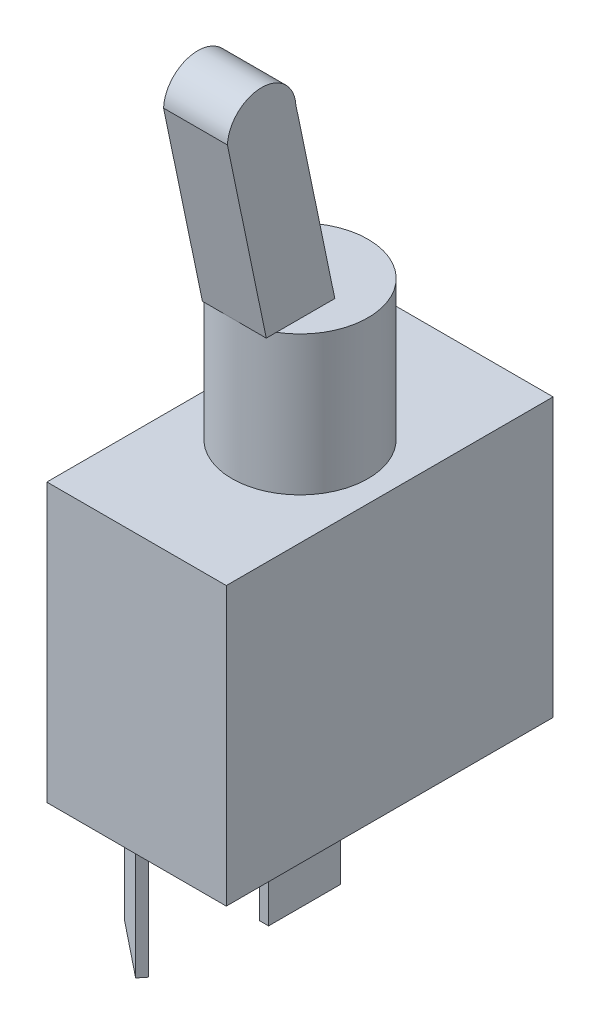
ISO-10303-21;
HEADER;
FILE_DESCRIPTION(('STEP AP214'),'2;1');
FILE_NAME('part.step','',(''),(''),'','','');
FILE_SCHEMA(('AUTOMOTIVE_DESIGN { 1 0 10303 214 1 1 1 1 }'));
ENDSEC;
DATA;
#1=APPLICATION_CONTEXT('core data for automotive mechanical design processes');
#2=APPLICATION_PROTOCOL_DEFINITION('international standard','automotive_design',2000,#1);
#3=PRODUCT_CONTEXT('',#1,'mechanical');
#4=PRODUCT('Part','Part','',(#3));
#5=PRODUCT_RELATED_PRODUCT_CATEGORY('part','',(#4));
#6=PRODUCT_DEFINITION_FORMATION('','',#4);
#7=PRODUCT_DEFINITION_CONTEXT('part definition',#1,'design');
#8=PRODUCT_DEFINITION('design','',#6,#7);
#9=PRODUCT_DEFINITION_SHAPE('','',#8);
#10=(LENGTH_UNIT() NAMED_UNIT(*) SI_UNIT(.MILLI.,.METRE.));
#11=(NAMED_UNIT(*) PLANE_ANGLE_UNIT() SI_UNIT($,.RADIAN.));
#12=(NAMED_UNIT(*) SI_UNIT($,.STERADIAN.) SOLID_ANGLE_UNIT());
#13=UNCERTAINTY_MEASURE_WITH_UNIT(LENGTH_MEASURE(1.E-05),#10,'distance_accuracy_value','');
#14=(GEOMETRIC_REPRESENTATION_CONTEXT(3) GLOBAL_UNCERTAINTY_ASSIGNED_CONTEXT((#13)) GLOBAL_UNIT_ASSIGNED_CONTEXT((#10,
#11,#12)) REPRESENTATION_CONTEXT('',''));
#15=CARTESIAN_POINT('',(0.,0.,0.));
#16=DIRECTION('',(0.,0.,1.));
#17=DIRECTION('',(1.,0.,0.));
#18=AXIS2_PLACEMENT_3D('',#15,#16,#17);
#19=CARTESIAN_POINT('',(0.,0.,0.));
#20=DIRECTION('',(0.,1.,0.));
#21=DIRECTION('',(0.,0.,1.));
#22=AXIS2_PLACEMENT_3D('',#19,#20,#21);
#23=PLANE('',#22);
#24=DIRECTION('',(0.,0.,-1.));
#25=VECTOR('',#24,1.);
#26=CARTESIAN_POINT('',(-0.400000000000001,0.,3.15));
#27=LINE('',#26,#25);
#28=CARTESIAN_POINT('',(-0.400000000000001,0.,3.15));
#29=VERTEX_POINT('',#28);
#30=CARTESIAN_POINT('',(-0.4,0.,-3.15));
#31=VERTEX_POINT('',#30);
#32=EDGE_CURVE('E175',#29,#31,#27,.T.);
#33=ORIENTED_EDGE('',*,*,#32,.F.);
#34=DIRECTION('',(-1.,0.,0.));
#35=VECTOR('',#34,1.);
#36=CARTESIAN_POINT('',(-0.400000000000001,0.,3.15));
#37=LINE('',#36,#35);
#38=CARTESIAN_POINT('',(0.399999999999999,0.,3.15));
#39=VERTEX_POINT('',#38);
#40=EDGE_CURVE('E188',#39,#29,#37,.T.);
#41=ORIENTED_EDGE('',*,*,#40,.F.);
#42=DIRECTION('',(0.,0.,1.));
#43=VECTOR('',#42,1.);
#44=CARTESIAN_POINT('',(0.399999999999999,0.,3.15));
#45=LINE('',#44,#43);
#46=CARTESIAN_POINT('',(0.4,0.,-3.15));
#47=VERTEX_POINT('',#46);
#48=EDGE_CURVE('E197',#47,#39,#45,.T.);
#49=ORIENTED_EDGE('',*,*,#48,.F.);
#50=DIRECTION('',(1.,0.,0.));
#51=VECTOR('',#50,1.);
#52=CARTESIAN_POINT('',(-0.4,0.,-3.15));
#53=LINE('',#52,#51);
#54=EDGE_CURVE('E178',#31,#47,#53,.T.);
#55=ORIENTED_EDGE('',*,*,#54,.F.);
#56=EDGE_LOOP('',(#33,#41,#49,#55));
#57=FACE_BOUND('',#56,.T.);
#58=DIRECTION('',(0.,0.,-1.));
#59=VECTOR('',#58,1.);
#60=CARTESIAN_POINT('',(7.85,0.,-14.3));
#61=LINE('',#60,#59);
#62=CARTESIAN_POINT('',(7.85,0.,14.3));
#63=VERTEX_POINT('',#62);
#64=CARTESIAN_POINT('',(7.85,0.,-14.3));
#65=VERTEX_POINT('',#64);
#66=EDGE_CURVE('E248',#63,#65,#61,.T.);
#67=ORIENTED_EDGE('',*,*,#66,.F.);
#68=DIRECTION('',(1.,0.,0.));
#69=VECTOR('',#68,1.);
#70=CARTESIAN_POINT('',(-7.85,0.,14.3));
#71=LINE('',#70,#69);
#72=CARTESIAN_POINT('',(-7.85,0.,14.3));
#73=VERTEX_POINT('',#72);
#74=EDGE_CURVE('E256',#73,#63,#71,.T.);
#75=ORIENTED_EDGE('',*,*,#74,.F.);
#76=DIRECTION('',(0.,0.,1.));
#77=VECTOR('',#76,1.);
#78=CARTESIAN_POINT('',(-7.85,0.,-14.3));
#79=LINE('',#78,#77);
#80=CARTESIAN_POINT('',(-7.85,0.,-14.3));
#81=VERTEX_POINT('',#80);
#82=EDGE_CURVE('E267',#81,#73,#79,.T.);
#83=ORIENTED_EDGE('',*,*,#82,.F.);
#84=DIRECTION('',(-1.,0.,0.));
#85=VECTOR('',#84,1.);
#86=CARTESIAN_POINT('',(-7.85,0.,-14.3));
#87=LINE('',#86,#85);
#88=EDGE_CURVE('E265',#65,#81,#87,.T.);
#89=ORIENTED_EDGE('',*,*,#88,.F.);
#90=EDGE_LOOP('',(#67,#75,#83,#89));
#91=FACE_BOUND('',#90,.T.);
#92=DIRECTION('',(-0.780868809443029,0.,-0.624695047554426));
#93=VECTOR('',#92,1.);
#94=CARTESIAN_POINT('',(-6.39093150433474,0.,8.97678211683683));
#95=LINE('',#94,#93);
#96=CARTESIAN_POINT('',(-1.47145800484366,0.,12.9123609164297));
#97=VERTEX_POINT('',#96);
#98=CARTESIAN_POINT('',(-6.39093150433474,0.,8.97678211683683));
#99=VERTEX_POINT('',#98);
#100=EDGE_CURVE('E174',#97,#99,#95,.T.);
#101=ORIENTED_EDGE('',*,*,#100,.F.);
#102=DIRECTION('',(-0.624695047554425,0.,0.78086880944303));
#103=VECTOR('',#102,1.);
#104=CARTESIAN_POINT('',(-1.47145800484366,0.,12.9123609164297));
#105=LINE('',#104,#103);
#106=CARTESIAN_POINT('',(-0.971701966800116,0.,12.2876658688753));
#107=VERTEX_POINT('',#106);
#108=EDGE_CURVE('E171',#107,#97,#105,.T.);
#109=ORIENTED_EDGE('',*,*,#108,.F.);
#110=DIRECTION('',(0.780868809443029,0.,0.624695047554426));
#111=VECTOR('',#110,1.);
#112=CARTESIAN_POINT('',(-5.8911754662912,0.,8.35208706928241));
#113=LINE('',#112,#111);
#114=CARTESIAN_POINT('',(-5.8911754662912,0.,8.35208706928241));
#115=VERTEX_POINT('',#114);
#116=EDGE_CURVE('E56',#115,#107,#113,.T.);
#117=ORIENTED_EDGE('',*,*,#116,.F.);
#118=DIRECTION('',(0.624695047554426,0.,-0.780868809443029));
#119=VECTOR('',#118,1.);
#120=CARTESIAN_POINT('',(-6.39093150433474,0.,8.97678211683683));
#121=LINE('',#120,#119);
#122=EDGE_CURVE('E51',#99,#115,#121,.T.);
#123=ORIENTED_EDGE('',*,*,#122,.F.);
#124=EDGE_LOOP('',(#101,#109,#117,#123));
#125=FACE_BOUND('',#124,.T.);
#126=ADVANCED_FACE('F33',(#57,#91,#125),#23,.F.);
#127=CARTESIAN_POINT('',(7.85,24.3,-14.3));
#128=DIRECTION('',(-1.,0.,0.));
#129=DIRECTION('',(0.,0.,1.));
#130=AXIS2_PLACEMENT_3D('',#127,#128,#129);
#131=PLANE('',#130);
#132=ORIENTED_EDGE('',*,*,#66,.T.);
#133=DIRECTION('',(0.,-1.,0.));
#134=VECTOR('',#133,1.);
#135=CARTESIAN_POINT('',(7.85,24.3,-14.3));
#136=LINE('',#135,#134);
#137=CARTESIAN_POINT('',(7.85,24.3,-14.3));
#138=VERTEX_POINT('',#137);
#139=EDGE_CURVE('E37',#138,#65,#136,.T.);
#140=ORIENTED_EDGE('',*,*,#139,.F.);
#141=DIRECTION('',(0.,0.,-1.));
#142=VECTOR('',#141,1.);
#143=CARTESIAN_POINT('',(7.85,24.3,-14.3));
#144=LINE('',#143,#142);
#145=CARTESIAN_POINT('',(7.85,24.3,14.3));
#146=VERTEX_POINT('',#145);
#147=EDGE_CURVE('E252',#146,#138,#144,.T.);
#148=ORIENTED_EDGE('',*,*,#147,.F.);
#149=DIRECTION('',(0.,-1.,0.));
#150=VECTOR('',#149,1.);
#151=CARTESIAN_POINT('',(7.85,24.3,14.3));
#152=LINE('',#151,#150);
#153=EDGE_CURVE('E262',#146,#63,#152,.T.);
#154=ORIENTED_EDGE('',*,*,#153,.T.);
#155=EDGE_LOOP('',(#132,#140,#148,#154));
#156=FACE_BOUND('',#155,.T.);
#157=ADVANCED_FACE('F35',(#156),#131,.F.);
#158=CARTESIAN_POINT('',(-7.85,24.3,-14.3));
#159=DIRECTION('',(0.,0.,1.));
#160=DIRECTION('',(1.,0.,0.));
#161=AXIS2_PLACEMENT_3D('',#158,#159,#160);
#162=PLANE('',#161);
#163=ORIENTED_EDGE('',*,*,#88,.T.);
#164=DIRECTION('',(0.,-1.,0.));
#165=VECTOR('',#164,1.);
#166=CARTESIAN_POINT('',(-7.85,24.3,-14.3));
#167=LINE('',#166,#165);
#168=CARTESIAN_POINT('',(-7.85,24.3,-14.3));
#169=VERTEX_POINT('',#168);
#170=EDGE_CURVE('E274',#169,#81,#167,.T.);
#171=ORIENTED_EDGE('',*,*,#170,.F.);
#172=DIRECTION('',(-1.,0.,0.));
#173=VECTOR('',#172,1.);
#174=CARTESIAN_POINT('',(-7.85,24.3,-14.3));
#175=LINE('',#174,#173);
#176=EDGE_CURVE('E255',#138,#169,#175,.T.);
#177=ORIENTED_EDGE('',*,*,#176,.F.);
#178=ORIENTED_EDGE('',*,*,#139,.T.);
#179=EDGE_LOOP('',(#163,#171,#177,#178));
#180=FACE_BOUND('',#179,.T.);
#181=ADVANCED_FACE('F317',(#180),#162,.F.);
#182=CARTESIAN_POINT('',(-7.85,24.3,-14.3));
#183=DIRECTION('',(1.,0.,0.));
#184=DIRECTION('',(0.,0.,-1.));
#185=AXIS2_PLACEMENT_3D('',#182,#183,#184);
#186=PLANE('',#185);
#187=ORIENTED_EDGE('',*,*,#82,.T.);
#188=DIRECTION('',(0.,-1.,0.));
#189=VECTOR('',#188,1.);
#190=CARTESIAN_POINT('',(-7.85,24.3,14.3));
#191=LINE('',#190,#189);
#192=CARTESIAN_POINT('',(-7.85,24.3,14.3));
#193=VERTEX_POINT('',#192);
#194=EDGE_CURVE('E272',#193,#73,#191,.T.);
#195=ORIENTED_EDGE('',*,*,#194,.F.);
#196=DIRECTION('',(0.,0.,1.));
#197=VECTOR('',#196,1.);
#198=CARTESIAN_POINT('',(-7.85,24.3,-14.3));
#199=LINE('',#198,#197);
#200=EDGE_CURVE('E258',#169,#193,#199,.T.);
#201=ORIENTED_EDGE('',*,*,#200,.F.);
#202=ORIENTED_EDGE('',*,*,#170,.T.);
#203=EDGE_LOOP('',(#187,#195,#201,#202));
#204=FACE_BOUND('',#203,.T.);
#205=ADVANCED_FACE('F319',(#204),#186,.F.);
#206=CARTESIAN_POINT('',(-7.85,24.3,14.3));
#207=DIRECTION('',(0.,0.,-1.));
#208=DIRECTION('',(-1.,0.,0.));
#209=AXIS2_PLACEMENT_3D('',#206,#207,#208);
#210=PLANE('',#209);
#211=ORIENTED_EDGE('',*,*,#74,.T.);
#212=ORIENTED_EDGE('',*,*,#153,.F.);
#213=DIRECTION('',(1.,0.,0.));
#214=VECTOR('',#213,1.);
#215=CARTESIAN_POINT('',(-7.85,24.3,14.3));
#216=LINE('',#215,#214);
#217=EDGE_CURVE('E260',#193,#146,#216,.T.);
#218=ORIENTED_EDGE('',*,*,#217,.F.);
#219=ORIENTED_EDGE('',*,*,#194,.T.);
#220=EDGE_LOOP('',(#211,#212,#218,#219));
#221=FACE_BOUND('',#220,.T.);
#222=ADVANCED_FACE('F308',(#221),#210,.F.);
#223=CARTESIAN_POINT('',(0.,24.3,0.));
#224=DIRECTION('',(0.,1.,0.));
#225=DIRECTION('',(0.,0.,1.));
#226=AXIS2_PLACEMENT_3D('',#223,#224,#225);
#227=PLANE('',#226);
#228=CARTESIAN_POINT('',(0.,24.3,0.));
#229=DIRECTION('',(0.,1.,0.));
#230=DIRECTION('',(0.,0.,1.));
#231=AXIS2_PLACEMENT_3D('',#228,#229,#230);
#232=CIRCLE('',#231,5.953125);
#233=CARTESIAN_POINT('',(0.,24.3,5.953125));
#234=VERTEX_POINT('',#233);
#235=EDGE_CURVE('E239',#234,#234,#232,.T.);
#236=ORIENTED_EDGE('',*,*,#235,.F.);
#237=EDGE_LOOP('',(#236));
#238=FACE_BOUND('',#237,.T.);
#239=ORIENTED_EDGE('',*,*,#147,.T.);
#240=ORIENTED_EDGE('',*,*,#176,.T.);
#241=ORIENTED_EDGE('',*,*,#200,.T.);
#242=ORIENTED_EDGE('',*,*,#217,.T.);
#243=EDGE_LOOP('',(#239,#240,#241,#242));
#244=FACE_BOUND('',#243,.T.);
#245=ADVANCED_FACE('F302',(#238,#244),#227,.T.);
#246=CARTESIAN_POINT('',(0.,36.5,0.));
#247=DIRECTION('',(0.,-1.,0.));
#248=DIRECTION('',(0.,0.,-1.));
#249=AXIS2_PLACEMENT_3D('',#246,#247,#248);
#250=CYLINDRICAL_SURFACE('',#249,5.953125);
#251=CARTESIAN_POINT('',(0.,36.5,0.));
#252=DIRECTION('',(0.,1.,0.));
#253=DIRECTION('',(0.,0.,1.));
#254=AXIS2_PLACEMENT_3D('',#251,#252,#253);
#255=CIRCLE('',#254,5.953125);
#256=CARTESIAN_POINT('',(3.048,36.5,5.11364774555551));
#257=VERTEX_POINT('',#256);
#258=CARTESIAN_POINT('',(-2.54,36.5,5.38405955257044));
#259=VERTEX_POINT('',#258);
#260=EDGE_CURVE('E245',#257,#259,#255,.T.);
#261=ORIENTED_EDGE('',*,*,#260,.F.);
#262=EDGE_CURVE('E249',#259,#257,#255,.T.);
#263=ORIENTED_EDGE('',*,*,#262,.F.);
#264=EDGE_LOOP('',(#261,#263));
#265=FACE_BOUND('',#264,.T.);
#266=ORIENTED_EDGE('',*,*,#235,.T.);
#267=EDGE_LOOP('',(#266));
#268=FACE_BOUND('',#267,.T.);
#269=ADVANCED_FACE('F299',(#265,#268),#250,.T.);
#270=CARTESIAN_POINT('',(0.,36.5,0.));
#271=DIRECTION('',(0.,1.,0.));
#272=DIRECTION('',(0.,0.,1.));
#273=AXIS2_PLACEMENT_3D('',#270,#271,#272);
#274=PLANE('',#273);
#275=DIRECTION('',(0.,0.,-1.));
#276=VECTOR('',#275,1.);
#277=CARTESIAN_POINT('',(3.048,36.5,0.));
#278=LINE('',#277,#276);
#279=CARTESIAN_POINT('',(3.048,36.5,0.));
#280=VERTEX_POINT('',#279);
#281=EDGE_CURVE('E11',#257,#280,#278,.T.);
#282=ORIENTED_EDGE('',*,*,#281,.F.);
#283=ORIENTED_EDGE('',*,*,#260,.T.);
#284=DIRECTION('',(0.,0.,-1.));
#285=VECTOR('',#284,1.);
#286=CARTESIAN_POINT('',(-2.54,36.5,0.));
#287=LINE('',#286,#285);
#288=CARTESIAN_POINT('',(-2.54,36.5,0.));
#289=VERTEX_POINT('',#288);
#290=EDGE_CURVE('E42',#259,#289,#287,.T.);
#291=ORIENTED_EDGE('',*,*,#290,.T.);
#292=DIRECTION('',(1.,0.,0.));
#293=VECTOR('',#292,1.);
#294=CARTESIAN_POINT('',(-2.54,36.5,0.));
#295=LINE('',#294,#293);
#296=EDGE_CURVE('E236',#289,#280,#295,.T.);
#297=ORIENTED_EDGE('',*,*,#296,.T.);
#298=EDGE_LOOP('',(#282,#283,#291,#297));
#299=FACE_BOUND('',#298,.T.);
#300=ADVANCED_FACE('F286',(#299),#274,.T.);
#301=CARTESIAN_POINT('',(-2.54,36.5,0.));
#302=DIRECTION('',(0.,0.20373891327795,-0.979025257700903));
#303=DIRECTION('',(0.,0.979025257700903,0.20373891327795));
#304=AXIS2_PLACEMENT_3D('',#301,#302,#303);
#305=PLANE('',#304);
#306=DIRECTION('',(1.,0.,0.));
#307=VECTOR('',#306,1.);
#308=CARTESIAN_POINT('',(-2.54,52.8859666746955,3.40998254851059));
#309=LINE('',#308,#307);
#310=CARTESIAN_POINT('',(-2.54,52.8859666746955,3.40998254851059));
#311=VERTEX_POINT('',#310);
#312=CARTESIAN_POINT('',(3.048,52.8859666746955,3.40998254851059));
#313=VERTEX_POINT('',#312);
#314=EDGE_CURVE('E235',#311,#313,#309,.T.);
#315=ORIENTED_EDGE('',*,*,#314,.T.);
#316=DIRECTION('',(0.,0.979025257700903,0.20373891327795));
#317=VECTOR('',#316,1.);
#318=CARTESIAN_POINT('',(3.048,36.5,0.));
#319=LINE('',#318,#317);
#320=EDGE_CURVE('E213',#280,#313,#319,.T.);
#321=ORIENTED_EDGE('',*,*,#320,.F.);
#322=ORIENTED_EDGE('',*,*,#296,.F.);
#323=DIRECTION('',(0.,0.979025257700903,0.20373891327795));
#324=VECTOR('',#323,1.);
#325=CARTESIAN_POINT('',(-2.54,36.5,0.));
#326=LINE('',#325,#324);
#327=EDGE_CURVE('E223',#289,#311,#326,.T.);
#328=ORIENTED_EDGE('',*,*,#327,.T.);
#329=EDGE_LOOP('',(#315,#321,#322,#328));
#330=FACE_BOUND('',#329,.T.);
#331=ADVANCED_FACE('F336',(#330),#305,.T.);
#332=CARTESIAN_POINT('',(-2.54,36.5,0.));
#333=DIRECTION('',(0.,-1.,0.));
#334=DIRECTION('',(0.,0.,-1.));
#335=AXIS2_PLACEMENT_3D('',#332,#333,#334);
#336=PLANE('',#335);
#337=CARTESIAN_POINT('',(-2.54,36.5,6.));
#338=VERTEX_POINT('',#337);
#339=EDGE_CURVE('E232',#338,#259,#287,.T.);
#340=ORIENTED_EDGE('',*,*,#339,.T.);
#341=ORIENTED_EDGE('',*,*,#262,.T.);
#342=CARTESIAN_POINT('',(3.048,36.5,6.));
#343=VERTEX_POINT('',#342);
#344=EDGE_CURVE('E44',#343,#257,#278,.T.);
#345=ORIENTED_EDGE('',*,*,#344,.F.);
#346=DIRECTION('',(1.,0.,0.));
#347=VECTOR('',#346,1.);
#348=CARTESIAN_POINT('',(-2.54,36.5,6.));
#349=LINE('',#348,#347);
#350=EDGE_CURVE('E240',#338,#343,#349,.T.);
#351=ORIENTED_EDGE('',*,*,#350,.F.);
#352=EDGE_LOOP('',(#340,#341,#345,#351));
#353=FACE_BOUND('',#352,.T.);
#354=ADVANCED_FACE('F296',(#353),#336,.T.);
#355=CARTESIAN_POINT('',(-2.54,36.5,6.));
#356=DIRECTION('',(0.,-0.20373891327795,0.979025257700903));
#357=DIRECTION('',(0.,-0.979025257700903,-0.20373891327795));
#358=AXIS2_PLACEMENT_3D('',#355,#356,#357);
#359=PLANE('',#358);
#360=ORIENTED_EDGE('',*,*,#350,.T.);
#361=DIRECTION('',(0.,-0.979025257700903,-0.20373891327795));
#362=VECTOR('',#361,1.);
#363=CARTESIAN_POINT('',(3.048,36.5,6.));
#364=LINE('',#363,#362);
#365=CARTESIAN_POINT('',(3.048,52.8420688870723,9.40084725044212));
#366=VERTEX_POINT('',#365);
#367=EDGE_CURVE('E219',#366,#343,#364,.T.);
#368=ORIENTED_EDGE('',*,*,#367,.F.);
#369=DIRECTION('',(1.,0.,0.));
#370=VECTOR('',#369,1.);
#371=CARTESIAN_POINT('',(-2.54,52.8420688870723,9.40084725044212));
#372=LINE('',#371,#370);
#373=CARTESIAN_POINT('',(-2.54,52.8420688870723,9.40084725044212));
#374=VERTEX_POINT('',#373);
#375=EDGE_CURVE('E242',#374,#366,#372,.T.);
#376=ORIENTED_EDGE('',*,*,#375,.F.);
#377=DIRECTION('',(0.,-0.979025257700903,-0.20373891327795));
#378=VECTOR('',#377,1.);
#379=CARTESIAN_POINT('',(-2.54,36.5,6.));
#380=LINE('',#379,#378);
#381=EDGE_CURVE('E229',#374,#338,#380,.T.);
#382=ORIENTED_EDGE('',*,*,#381,.T.);
#383=EDGE_LOOP('',(#360,#368,#376,#382));
#384=FACE_BOUND('',#383,.T.);
#385=ADVANCED_FACE('F343',(#384),#359,.T.);
#386=CARTESIAN_POINT('',(-2.54,52.7,6.40421306667426));
#387=DIRECTION('',(1.,0.,0.));
#388=DIRECTION('',(0.,0.,-1.));
#389=AXIS2_PLACEMENT_3D('',#386,#387,#388);
#390=CYLINDRICAL_SURFACE('',#389,3.);
#391=ORIENTED_EDGE('',*,*,#375,.T.);
#392=CARTESIAN_POINT('',(3.048,52.7,6.40421306667426));
#393=DIRECTION('',(1.,0.,0.));
#394=DIRECTION('',(0.,0.,-1.));
#395=AXIS2_PLACEMENT_3D('',#392,#393,#394);
#396=CIRCLE('',#395,3.);
#397=EDGE_CURVE('E216',#313,#366,#396,.T.);
#398=ORIENTED_EDGE('',*,*,#397,.F.);
#399=ORIENTED_EDGE('',*,*,#314,.F.);
#400=CARTESIAN_POINT('',(-2.54,52.7,6.40421306667426));
#401=DIRECTION('',(1.,0.,0.));
#402=DIRECTION('',(0.,0.,-1.));
#403=AXIS2_PLACEMENT_3D('',#400,#401,#402);
#404=CIRCLE('',#403,3.);
#405=EDGE_CURVE('E226',#311,#374,#404,.T.);
#406=ORIENTED_EDGE('',*,*,#405,.T.);
#407=EDGE_LOOP('',(#391,#398,#399,#406));
#408=FACE_BOUND('',#407,.T.);
#409=ADVANCED_FACE('F340',(#408),#390,.T.);
#410=CARTESIAN_POINT('',(-2.54,52.7,6.40421306667426));
#411=DIRECTION('',(1.,0.,0.));
#412=DIRECTION('',(0.,0.,-1.));
#413=AXIS2_PLACEMENT_3D('',#410,#411,#412);
#414=PLANE('',#413);
#415=ORIENTED_EDGE('',*,*,#327,.F.);
#416=ORIENTED_EDGE('',*,*,#290,.F.);
#417=ORIENTED_EDGE('',*,*,#339,.F.);
#418=ORIENTED_EDGE('',*,*,#381,.F.);
#419=ORIENTED_EDGE('',*,*,#405,.F.);
#420=EDGE_LOOP('',(#415,#416,#417,#418,#419));
#421=FACE_BOUND('',#420,.T.);
#422=ADVANCED_FACE('F291',(#421),#414,.F.);
#423=CARTESIAN_POINT('',(3.048,52.7,6.40421306667426));
#424=DIRECTION('',(1.,0.,0.));
#425=DIRECTION('',(0.,0.,-1.));
#426=AXIS2_PLACEMENT_3D('',#423,#424,#425);
#427=PLANE('',#426);
#428=ORIENTED_EDGE('',*,*,#320,.T.);
#429=ORIENTED_EDGE('',*,*,#397,.T.);
#430=ORIENTED_EDGE('',*,*,#367,.T.);
#431=ORIENTED_EDGE('',*,*,#344,.T.);
#432=ORIENTED_EDGE('',*,*,#281,.T.);
#433=EDGE_LOOP('',(#428,#429,#430,#431,#432));
#434=FACE_BOUND('',#433,.T.);
#435=ADVANCED_FACE('F352',(#434),#427,.T.);
#436=CARTESIAN_POINT('',(-0.400000000000001,-10.8,3.15));
#437=DIRECTION('',(1.,0.,0.));
#438=DIRECTION('',(0.,0.,-1.));
#439=AXIS2_PLACEMENT_3D('',#436,#437,#438);
#440=PLANE('',#439);
#441=ORIENTED_EDGE('',*,*,#32,.T.);
#442=DIRECTION('',(0.,1.,0.));
#443=VECTOR('',#442,1.);
#444=CARTESIAN_POINT('',(-0.4,-10.8,-3.15));
#445=LINE('',#444,#443);
#446=CARTESIAN_POINT('',(-0.4,-10.8,-3.15));
#447=VERTEX_POINT('',#446);
#448=EDGE_CURVE('E210',#447,#31,#445,.T.);
#449=ORIENTED_EDGE('',*,*,#448,.F.);
#450=DIRECTION('',(0.,0.,-1.));
#451=VECTOR('',#450,1.);
#452=CARTESIAN_POINT('',(-0.400000000000001,-10.8,3.15));
#453=LINE('',#452,#451);
#454=CARTESIAN_POINT('',(-0.400000000000001,-10.8,3.15));
#455=VERTEX_POINT('',#454);
#456=EDGE_CURVE('E184',#455,#447,#453,.T.);
#457=ORIENTED_EDGE('',*,*,#456,.F.);
#458=DIRECTION('',(0.,1.,0.));
#459=VECTOR('',#458,1.);
#460=CARTESIAN_POINT('',(-0.400000000000001,-10.8,3.15));
#461=LINE('',#460,#459);
#462=EDGE_CURVE('E193',#455,#29,#461,.T.);
#463=ORIENTED_EDGE('',*,*,#462,.T.);
#464=EDGE_LOOP('',(#441,#449,#457,#463));
#465=FACE_BOUND('',#464,.T.);
#466=ADVANCED_FACE('F355',(#465),#440,.F.);
#467=CARTESIAN_POINT('',(-0.4,-10.8,-3.15));
#468=DIRECTION('',(0.,0.,1.));
#469=DIRECTION('',(1.,0.,0.));
#470=AXIS2_PLACEMENT_3D('',#467,#468,#469);
#471=PLANE('',#470);
#472=ORIENTED_EDGE('',*,*,#54,.T.);
#473=DIRECTION('',(0.,1.,0.));
#474=VECTOR('',#473,1.);
#475=CARTESIAN_POINT('',(0.4,-10.8,-3.15));
#476=LINE('',#475,#474);
#477=CARTESIAN_POINT('',(0.4,-10.8,-3.15));
#478=VERTEX_POINT('',#477);
#479=EDGE_CURVE('E207',#478,#47,#476,.T.);
#480=ORIENTED_EDGE('',*,*,#479,.F.);
#481=DIRECTION('',(1.,0.,0.));
#482=VECTOR('',#481,1.);
#483=CARTESIAN_POINT('',(-0.4,-10.8,-3.15));
#484=LINE('',#483,#482);
#485=EDGE_CURVE('E187',#447,#478,#484,.T.);
#486=ORIENTED_EDGE('',*,*,#485,.F.);
#487=ORIENTED_EDGE('',*,*,#448,.T.);
#488=EDGE_LOOP('',(#472,#480,#486,#487));
#489=FACE_BOUND('',#488,.T.);
#490=ADVANCED_FACE('F359',(#489),#471,.F.);
#491=CARTESIAN_POINT('',(0.399999999999999,-10.8,3.15));
#492=DIRECTION('',(-1.,0.,0.));
#493=DIRECTION('',(0.,0.,1.));
#494=AXIS2_PLACEMENT_3D('',#491,#492,#493);
#495=PLANE('',#494);
#496=ORIENTED_EDGE('',*,*,#48,.T.);
#497=DIRECTION('',(0.,1.,0.));
#498=VECTOR('',#497,1.);
#499=CARTESIAN_POINT('',(0.399999999999999,-10.8,3.15));
#500=LINE('',#499,#498);
#501=CARTESIAN_POINT('',(0.399999999999999,-10.8,3.15));
#502=VERTEX_POINT('',#501);
#503=EDGE_CURVE('E204',#502,#39,#500,.T.);
#504=ORIENTED_EDGE('',*,*,#503,.F.);
#505=DIRECTION('',(0.,0.,1.));
#506=VECTOR('',#505,1.);
#507=CARTESIAN_POINT('',(0.399999999999999,-10.8,3.15));
#508=LINE('',#507,#506);
#509=EDGE_CURVE('E190',#478,#502,#508,.T.);
#510=ORIENTED_EDGE('',*,*,#509,.F.);
#511=ORIENTED_EDGE('',*,*,#479,.T.);
#512=EDGE_LOOP('',(#496,#504,#510,#511));
#513=FACE_BOUND('',#512,.T.);
#514=ADVANCED_FACE('F363',(#513),#495,.F.);
#515=CARTESIAN_POINT('',(-0.400000000000001,-10.8,3.15));
#516=DIRECTION('',(0.,0.,-1.));
#517=DIRECTION('',(-1.,0.,0.));
#518=AXIS2_PLACEMENT_3D('',#515,#516,#517);
#519=PLANE('',#518);
#520=ORIENTED_EDGE('',*,*,#40,.T.);
#521=ORIENTED_EDGE('',*,*,#462,.F.);
#522=DIRECTION('',(-1.,0.,0.));
#523=VECTOR('',#522,1.);
#524=CARTESIAN_POINT('',(-0.400000000000001,-10.8,3.15));
#525=LINE('',#524,#523);
#526=EDGE_CURVE('E192',#502,#455,#525,.T.);
#527=ORIENTED_EDGE('',*,*,#526,.F.);
#528=ORIENTED_EDGE('',*,*,#503,.T.);
#529=EDGE_LOOP('',(#520,#521,#527,#528));
#530=FACE_BOUND('',#529,.T.);
#531=ADVANCED_FACE('F367',(#530),#519,.F.);
#532=CARTESIAN_POINT('',(0.,-10.8,0.));
#533=DIRECTION('',(0.,-1.,0.));
#534=DIRECTION('',(0.,0.,-1.));
#535=AXIS2_PLACEMENT_3D('',#532,#533,#534);
#536=PLANE('',#535);
#537=ORIENTED_EDGE('',*,*,#456,.T.);
#538=ORIENTED_EDGE('',*,*,#485,.T.);
#539=ORIENTED_EDGE('',*,*,#509,.T.);
#540=ORIENTED_EDGE('',*,*,#526,.T.);
#541=EDGE_LOOP('',(#537,#538,#539,#540));
#542=FACE_BOUND('',#541,.T.);
#543=ADVANCED_FACE('F371',(#542),#536,.T.);
#544=CARTESIAN_POINT('',(-6.39093150433474,-10.8,8.97678211683683));
#545=DIRECTION('',(0.624695047554426,0.,-0.780868809443029));
#546=DIRECTION('',(-0.780868809443029,0.,-0.624695047554426));
#547=AXIS2_PLACEMENT_3D('',#544,#545,#546);
#548=PLANE('',#547);
#549=ORIENTED_EDGE('',*,*,#100,.T.);
#550=DIRECTION('',(0.,1.,0.));
#551=VECTOR('',#550,1.);
#552=CARTESIAN_POINT('',(-6.39093150433474,-10.8,8.97678211683683));
#553=LINE('',#552,#551);
#554=CARTESIAN_POINT('',(-6.39093150433474,-10.8,8.97678211683683));
#555=VERTEX_POINT('',#554);
#556=EDGE_CURVE('E155',#555,#99,#553,.T.);
#557=ORIENTED_EDGE('',*,*,#556,.F.);
#558=DIRECTION('',(-0.780868809443029,0.,-0.624695047554426));
#559=VECTOR('',#558,1.);
#560=CARTESIAN_POINT('',(-6.39093150433474,-10.8,8.97678211683683));
#561=LINE('',#560,#559);
#562=CARTESIAN_POINT('',(-1.47145800484366,-10.8,12.9123609164297));
#563=VERTEX_POINT('',#562);
#564=EDGE_CURVE('E162',#563,#555,#561,.T.);
#565=ORIENTED_EDGE('',*,*,#564,.F.);
#566=DIRECTION('',(0.,1.,0.));
#567=VECTOR('',#566,1.);
#568=CARTESIAN_POINT('',(-1.47145800484366,-10.8,12.9123609164297));
#569=LINE('',#568,#567);
#570=EDGE_CURVE('E532',#563,#97,#569,.T.);
#571=ORIENTED_EDGE('',*,*,#570,.T.);
#572=EDGE_LOOP('',(#549,#557,#565,#571));
#573=FACE_BOUND('',#572,.T.);
#574=ADVANCED_FACE('F173',(#573),#548,.F.);
#575=CARTESIAN_POINT('',(-6.39093150433474,-10.8,8.97678211683683));
#576=DIRECTION('',(0.780868809443029,0.,0.624695047554426));
#577=DIRECTION('',(0.624695047554426,0.,-0.780868809443029));
#578=AXIS2_PLACEMENT_3D('',#575,#576,#577);
#579=PLANE('',#578);
#580=ORIENTED_EDGE('',*,*,#122,.T.);
#581=DIRECTION('',(0.,1.,0.));
#582=VECTOR('',#581,1.);
#583=CARTESIAN_POINT('',(-5.8911754662912,-10.8,8.35208706928241));
#584=LINE('',#583,#582);
#585=CARTESIAN_POINT('',(-5.8911754662912,-10.8,8.35208706928241));
#586=VERTEX_POINT('',#585);
#587=EDGE_CURVE('E158',#586,#115,#584,.T.);
#588=ORIENTED_EDGE('',*,*,#587,.F.);
#589=DIRECTION('',(0.624695047554426,0.,-0.780868809443029));
#590=VECTOR('',#589,1.);
#591=CARTESIAN_POINT('',(-6.39093150433474,-10.8,8.97678211683683));
#592=LINE('',#591,#590);
#593=EDGE_CURVE('E151',#555,#586,#592,.T.);
#594=ORIENTED_EDGE('',*,*,#593,.F.);
#595=ORIENTED_EDGE('',*,*,#556,.T.);
#596=EDGE_LOOP('',(#580,#588,#594,#595));
#597=FACE_BOUND('',#596,.T.);
#598=ADVANCED_FACE('F153',(#597),#579,.F.);
#599=CARTESIAN_POINT('',(-5.8911754662912,-10.8,8.35208706928241));
#600=DIRECTION('',(-0.624695047554426,0.,0.780868809443029));
#601=DIRECTION('',(0.780868809443029,0.,0.624695047554426));
#602=AXIS2_PLACEMENT_3D('',#599,#600,#601);
#603=PLANE('',#602);
#604=ORIENTED_EDGE('',*,*,#116,.T.);
#605=DIRECTION('',(0.,1.,0.));
#606=VECTOR('',#605,1.);
#607=CARTESIAN_POINT('',(-0.971701966800118,-10.8,12.2876658688753));
#608=LINE('',#607,#606);
#609=CARTESIAN_POINT('',(-0.971701966800118,-10.8,12.2876658688753));
#610=VERTEX_POINT('',#609);
#611=EDGE_CURVE('E180',#610,#107,#608,.T.);
#612=ORIENTED_EDGE('',*,*,#611,.F.);
#613=DIRECTION('',(0.780868809443029,0.,0.624695047554426));
#614=VECTOR('',#613,1.);
#615=CARTESIAN_POINT('',(-5.8911754662912,-10.8,8.35208706928241));
#616=LINE('',#615,#614);
#617=EDGE_CURVE('E161',#586,#610,#616,.T.);
#618=ORIENTED_EDGE('',*,*,#617,.F.);
#619=ORIENTED_EDGE('',*,*,#587,.T.);
#620=EDGE_LOOP('',(#604,#612,#618,#619));
#621=FACE_BOUND('',#620,.T.);
#622=ADVANCED_FACE('F380',(#621),#603,.F.);
#623=CARTESIAN_POINT('',(-1.47145800484366,-10.8,12.9123609164297));
#624=DIRECTION('',(-0.78086880944303,0.,-0.624695047554425));
#625=DIRECTION('',(-0.624695047554425,0.,0.78086880944303));
#626=AXIS2_PLACEMENT_3D('',#623,#624,#625);
#627=PLANE('',#626);
#628=ORIENTED_EDGE('',*,*,#108,.T.);
#629=ORIENTED_EDGE('',*,*,#570,.F.);
#630=DIRECTION('',(-0.624695047554425,0.,0.78086880944303));
#631=VECTOR('',#630,1.);
#632=CARTESIAN_POINT('',(-1.47145800484366,-10.8,12.9123609164297));
#633=LINE('',#632,#631);
#634=EDGE_CURVE('E167',#610,#563,#633,.T.);
#635=ORIENTED_EDGE('',*,*,#634,.F.);
#636=ORIENTED_EDGE('',*,*,#611,.T.);
#637=EDGE_LOOP('',(#628,#629,#635,#636));
#638=FACE_BOUND('',#637,.T.);
#639=ADVANCED_FACE('F383',(#638),#627,.F.);
#640=CARTESIAN_POINT('',(0.,-10.8,0.));
#641=DIRECTION('',(0.,1.,0.));
#642=DIRECTION('',(0.,0.,1.));
#643=AXIS2_PLACEMENT_3D('',#640,#641,#642);
#644=PLANE('',#643);
#645=ORIENTED_EDGE('',*,*,#564,.T.);
#646=ORIENTED_EDGE('',*,*,#593,.T.);
#647=ORIENTED_EDGE('',*,*,#617,.T.);
#648=ORIENTED_EDGE('',*,*,#634,.T.);
#649=EDGE_LOOP('',(#645,#646,#647,#648));
#650=FACE_BOUND('',#649,.T.);
#651=ADVANCED_FACE('F165',(#650),#644,.F.);
#652=CLOSED_SHELL('',(#126,#157,#181,#205,#222,#245,#269,#300,#331,#354,#385,#409,#422,#435,
#466,#490,#514,#531,#543,#574,#598,#622,#639,#651));
#653=MANIFOLD_SOLID_BREP('B2',#652);
#654=ADVANCED_BREP_SHAPE_REPRESENTATION('',(#18,#653),#14);
#655=SHAPE_DEFINITION_REPRESENTATION(#9,#654);
ENDSEC;
END-ISO-10303-21;
